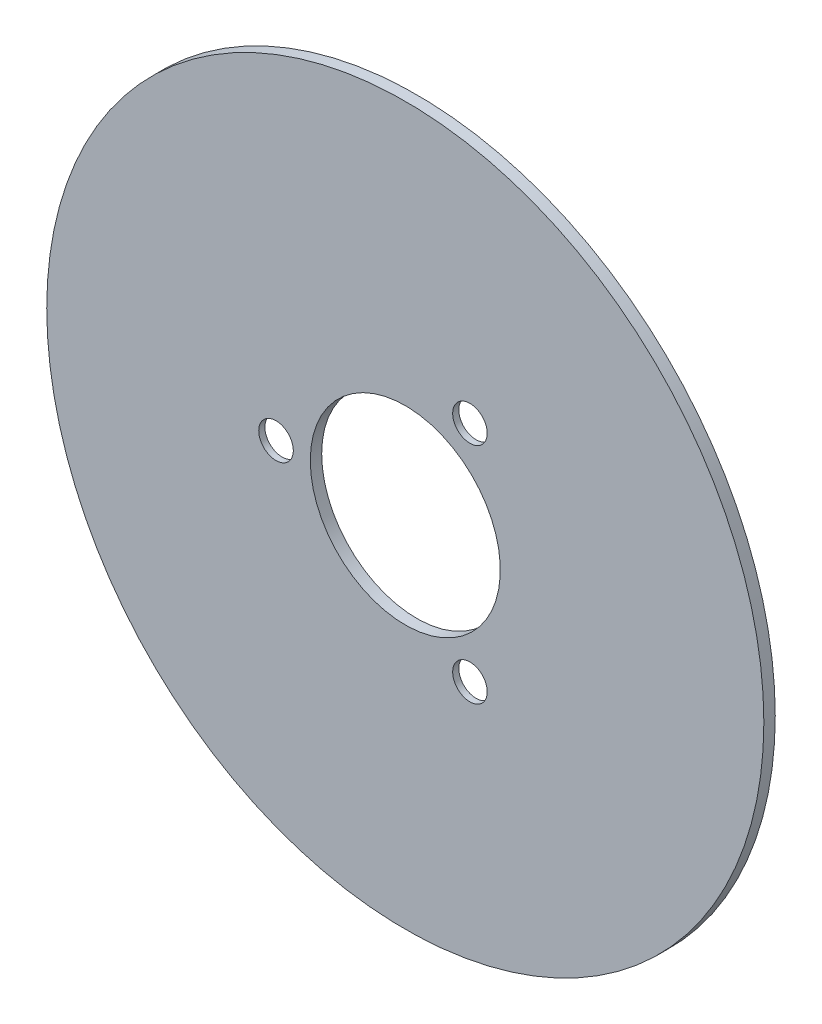
ISO-10303-21;
HEADER;
FILE_DESCRIPTION(('STEP AP214'),'2;1');
FILE_NAME('part.step','',(''),(''),'','','');
FILE_SCHEMA(('AUTOMOTIVE_DESIGN { 1 0 10303 214 1 1 1 1 }'));
ENDSEC;
DATA;
#1=APPLICATION_CONTEXT('core data for automotive mechanical design processes');
#2=APPLICATION_PROTOCOL_DEFINITION('international standard','automotive_design',2000,#1);
#3=PRODUCT_CONTEXT('',#1,'mechanical');
#4=PRODUCT('Part','Part','',(#3));
#5=PRODUCT_RELATED_PRODUCT_CATEGORY('part','',(#4));
#6=PRODUCT_DEFINITION_FORMATION('','',#4);
#7=PRODUCT_DEFINITION_CONTEXT('part definition',#1,'design');
#8=PRODUCT_DEFINITION('design','',#6,#7);
#9=PRODUCT_DEFINITION_SHAPE('','',#8);
#10=(LENGTH_UNIT() NAMED_UNIT(*) SI_UNIT(.MILLI.,.METRE.));
#11=(NAMED_UNIT(*) PLANE_ANGLE_UNIT() SI_UNIT($,.RADIAN.));
#12=(NAMED_UNIT(*) SI_UNIT($,.STERADIAN.) SOLID_ANGLE_UNIT());
#13=UNCERTAINTY_MEASURE_WITH_UNIT(LENGTH_MEASURE(1.E-05),#10,'distance_accuracy_value','');
#14=(GEOMETRIC_REPRESENTATION_CONTEXT(3) GLOBAL_UNCERTAINTY_ASSIGNED_CONTEXT((#13)) GLOBAL_UNIT_ASSIGNED_CONTEXT((#10,
#11,#12)) REPRESENTATION_CONTEXT('',''));
#15=CARTESIAN_POINT('',(0.,0.,0.));
#16=DIRECTION('',(0.,0.,1.));
#17=DIRECTION('',(1.,0.,0.));
#18=AXIS2_PLACEMENT_3D('',#15,#16,#17);
#19=CARTESIAN_POINT('',(0.,0.,3.5));
#20=DIRECTION('',(0.,0.,-1.));
#21=DIRECTION('',(-1.,0.,0.));
#22=AXIS2_PLACEMENT_3D('',#19,#20,#21);
#23=CYLINDRICAL_SURFACE('',#22,29.15);
#24=CARTESIAN_POINT('',(0.,0.,3.5));
#25=DIRECTION('',(0.,0.,-1.));
#26=DIRECTION('',(-1.,0.,0.));
#27=AXIS2_PLACEMENT_3D('',#24,#25,#26);
#28=CIRCLE('',#27,29.15);
#29=CARTESIAN_POINT('',(-29.15,0.,3.5));
#30=VERTEX_POINT('',#29);
#31=EDGE_CURVE('E56',#30,#30,#28,.T.);
#32=ORIENTED_EDGE('',*,*,#31,.F.);
#33=EDGE_LOOP('',(#32));
#34=FACE_BOUND('',#33,.T.);
#35=CARTESIAN_POINT('',(0.,0.,0.00100000000000013));
#36=DIRECTION('',(0.,0.,-1.));
#37=DIRECTION('',(-1.,0.,0.));
#38=AXIS2_PLACEMENT_3D('',#35,#36,#37);
#39=CIRCLE('',#38,29.15);
#40=CARTESIAN_POINT('',(-29.15,0.,0.00100000000000013));
#41=VERTEX_POINT('',#40);
#42=EDGE_CURVE('E91',#41,#41,#39,.F.);
#43=ORIENTED_EDGE('',*,*,#42,.F.);
#44=EDGE_LOOP('',(#43));
#45=FACE_BOUND('',#44,.T.);
#46=ADVANCED_FACE('F41',(#34,#45),#23,.F.);
#47=CARTESIAN_POINT('',(19.8312500000002,34.3487325776002,1.62));
#48=DIRECTION('',(0.,0.,-1.));
#49=DIRECTION('',(-1.,0.,0.));
#50=AXIS2_PLACEMENT_3D('',#47,#48,#49);
#51=CYLINDRICAL_SURFACE('',#50,8.55);
#52=CARTESIAN_POINT('',(19.8312500000002,34.3487325776002,1.62));
#53=DIRECTION('',(0.,0.,-1.));
#54=DIRECTION('',(-1.,0.,0.));
#55=AXIS2_PLACEMENT_3D('',#52,#53,#54);
#56=CIRCLE('',#55,8.55);
#57=CARTESIAN_POINT('',(11.2812500000002,34.3487325776002,1.62));
#58=VERTEX_POINT('',#57);
#59=EDGE_CURVE('E62',#58,#58,#56,.T.);
#60=ORIENTED_EDGE('',*,*,#59,.F.);
#61=EDGE_LOOP('',(#60));
#62=FACE_BOUND('',#61,.T.);
#63=CARTESIAN_POINT('',(19.8312500000002,34.3487325776002,0.000999999999999916));
#64=DIRECTION('',(0.,0.,-1.));
#65=DIRECTION('',(-1.,0.,0.));
#66=AXIS2_PLACEMENT_3D('',#63,#64,#65);
#67=CIRCLE('',#66,8.55);
#68=CARTESIAN_POINT('',(11.2812500000002,34.3487325776002,0.000999999999999916));
#69=VERTEX_POINT('',#68);
#70=EDGE_CURVE('E101',#69,#69,#67,.F.);
#71=ORIENTED_EDGE('',*,*,#70,.F.);
#72=EDGE_LOOP('',(#71));
#73=FACE_BOUND('',#72,.T.);
#74=ADVANCED_FACE('F136',(#62,#73),#51,.F.);
#75=CARTESIAN_POINT('',(19.8312500000002,-34.3487325776002,1.62));
#76=DIRECTION('',(0.,0.,-1.));
#77=DIRECTION('',(-1.,0.,0.));
#78=AXIS2_PLACEMENT_3D('',#75,#76,#77);
#79=CYLINDRICAL_SURFACE('',#78,8.55);
#80=CARTESIAN_POINT('',(19.8312500000002,-34.3487325776002,1.62));
#81=DIRECTION('',(0.,0.,-1.));
#82=DIRECTION('',(-1.,0.,0.));
#83=AXIS2_PLACEMENT_3D('',#80,#81,#82);
#84=CIRCLE('',#83,8.55);
#85=CARTESIAN_POINT('',(11.2812500000002,-34.3487325776002,1.62));
#86=VERTEX_POINT('',#85);
#87=EDGE_CURVE('E66',#86,#86,#84,.T.);
#88=ORIENTED_EDGE('',*,*,#87,.F.);
#89=EDGE_LOOP('',(#88));
#90=FACE_BOUND('',#89,.T.);
#91=CARTESIAN_POINT('',(19.8312500000002,-34.3487325776002,0.000999999999999916));
#92=DIRECTION('',(0.,0.,-1.));
#93=DIRECTION('',(-1.,0.,0.));
#94=AXIS2_PLACEMENT_3D('',#91,#92,#93);
#95=CIRCLE('',#94,8.55);
#96=CARTESIAN_POINT('',(11.2812500000002,-34.3487325776002,0.000999999999999916));
#97=VERTEX_POINT('',#96);
#98=EDGE_CURVE('E105',#97,#97,#95,.F.);
#99=ORIENTED_EDGE('',*,*,#98,.F.);
#100=EDGE_LOOP('',(#99));
#101=FACE_BOUND('',#100,.T.);
#102=ADVANCED_FACE('F127',(#90,#101),#79,.F.);
#103=CARTESIAN_POINT('',(-39.6625,0.,1.62));
#104=DIRECTION('',(0.,0.,-1.));
#105=DIRECTION('',(-1.,0.,0.));
#106=AXIS2_PLACEMENT_3D('',#103,#104,#105);
#107=CYLINDRICAL_SURFACE('',#106,8.55);
#108=CARTESIAN_POINT('',(-39.6625,0.,1.62));
#109=DIRECTION('',(0.,0.,-1.));
#110=DIRECTION('',(-1.,0.,0.));
#111=AXIS2_PLACEMENT_3D('',#108,#109,#110);
#112=CIRCLE('',#111,8.55);
#113=CARTESIAN_POINT('',(-48.2125,0.,1.62));
#114=VERTEX_POINT('',#113);
#115=EDGE_CURVE('E61',#114,#114,#112,.T.);
#116=ORIENTED_EDGE('',*,*,#115,.F.);
#117=EDGE_LOOP('',(#116));
#118=FACE_BOUND('',#117,.T.);
#119=CARTESIAN_POINT('',(-39.6625,0.,0.000999999999999916));
#120=DIRECTION('',(0.,0.,-1.));
#121=DIRECTION('',(-1.,0.,0.));
#122=AXIS2_PLACEMENT_3D('',#119,#120,#121);
#123=CIRCLE('',#122,8.55);
#124=CARTESIAN_POINT('',(-48.2125,0.,0.000999999999999916));
#125=VERTEX_POINT('',#124);
#126=EDGE_CURVE('E45',#125,#125,#123,.F.);
#127=ORIENTED_EDGE('',*,*,#126,.F.);
#128=EDGE_LOOP('',(#127));
#129=FACE_BOUND('',#128,.T.);
#130=ADVANCED_FACE('F125',(#118,#129),#107,.F.);
#131=CARTESIAN_POINT('',(0.,0.,3.5));
#132=DIRECTION('',(0.,0.,-1.));
#133=DIRECTION('',(-1.,0.,0.));
#134=AXIS2_PLACEMENT_3D('',#131,#132,#133);
#135=CYLINDRICAL_SURFACE('',#134,110.);
#136=CARTESIAN_POINT('',(0.,0.,3.5));
#137=DIRECTION('',(0.,0.,1.));
#138=DIRECTION('',(1.,0.,0.));
#139=AXIS2_PLACEMENT_3D('',#136,#137,#138);
#140=CIRCLE('',#139,110.);
#141=CARTESIAN_POINT('',(110.,0.,3.5));
#142=VERTEX_POINT('',#141);
#143=EDGE_CURVE('E10',#142,#142,#140,.T.);
#144=ORIENTED_EDGE('',*,*,#143,.F.);
#145=EDGE_LOOP('',(#144));
#146=FACE_BOUND('',#145,.T.);
#147=CARTESIAN_POINT('',(0.,0.,0.));
#148=DIRECTION('',(0.,0.,1.));
#149=DIRECTION('',(1.,0.,0.));
#150=AXIS2_PLACEMENT_3D('',#147,#148,#149);
#151=CIRCLE('',#150,110.);
#152=CARTESIAN_POINT('',(110.,0.,0.));
#153=VERTEX_POINT('',#152);
#154=EDGE_CURVE('E50',#153,#153,#151,.T.);
#155=ORIENTED_EDGE('',*,*,#154,.T.);
#156=EDGE_LOOP('',(#155));
#157=FACE_BOUND('',#156,.T.);
#158=ADVANCED_FACE('F43',(#146,#157),#135,.T.);
#159=CARTESIAN_POINT('',(0.,0.,3.5));
#160=DIRECTION('',(0.,0.,1.));
#161=DIRECTION('',(1.,0.,0.));
#162=AXIS2_PLACEMENT_3D('',#159,#160,#161);
#163=PLANE('',#162);
#164=CARTESIAN_POINT('',(19.8312500000002,-34.3487325776002,3.5));
#165=DIRECTION('',(0.,0.,-1.));
#166=DIRECTION('',(-1.,0.,0.));
#167=AXIS2_PLACEMENT_3D('',#164,#165,#166);
#168=CIRCLE('',#167,5.3);
#169=CARTESIAN_POINT('',(14.5312500000002,-34.3487325776002,3.5));
#170=VERTEX_POINT('',#169);
#171=EDGE_CURVE('E85',#170,#170,#168,.T.);
#172=ORIENTED_EDGE('',*,*,#171,.T.);
#173=EDGE_LOOP('',(#172));
#174=FACE_BOUND('',#173,.T.);
#175=CARTESIAN_POINT('',(-39.6625,0.,3.5));
#176=DIRECTION('',(0.,0.,-1.));
#177=DIRECTION('',(-1.,0.,0.));
#178=AXIS2_PLACEMENT_3D('',#175,#176,#177);
#179=CIRCLE('',#178,5.3);
#180=CARTESIAN_POINT('',(-44.9625,0.,3.5));
#181=VERTEX_POINT('',#180);
#182=EDGE_CURVE('E90',#181,#181,#179,.T.);
#183=ORIENTED_EDGE('',*,*,#182,.T.);
#184=EDGE_LOOP('',(#183));
#185=FACE_BOUND('',#184,.T.);
#186=CARTESIAN_POINT('',(19.8312500000002,34.3487325776002,3.5));
#187=DIRECTION('',(0.,0.,-1.));
#188=DIRECTION('',(-1.,0.,0.));
#189=AXIS2_PLACEMENT_3D('',#186,#187,#188);
#190=CIRCLE('',#189,5.3);
#191=CARTESIAN_POINT('',(14.5312500000002,34.3487325776002,3.5));
#192=VERTEX_POINT('',#191);
#193=EDGE_CURVE('E86',#192,#192,#190,.T.);
#194=ORIENTED_EDGE('',*,*,#193,.T.);
#195=EDGE_LOOP('',(#194));
#196=FACE_BOUND('',#195,.T.);
#197=ORIENTED_EDGE('',*,*,#31,.T.);
#198=EDGE_LOOP('',(#197));
#199=FACE_BOUND('',#198,.T.);
#200=ORIENTED_EDGE('',*,*,#143,.T.);
#201=EDGE_LOOP('',(#200));
#202=FACE_BOUND('',#201,.T.);
#203=ADVANCED_FACE('F134',(#174,#185,#196,#199,#202),#163,.T.);
#204=CARTESIAN_POINT('',(0.,0.,0.));
#205=DIRECTION('',(0.,0.,1.));
#206=DIRECTION('',(1.,0.,0.));
#207=AXIS2_PLACEMENT_3D('',#204,#205,#206);
#208=PLANE('',#207);
#209=CARTESIAN_POINT('',(0.,0.,0.));
#210=DIRECTION('',(0.,0.,-1.));
#211=DIRECTION('',(-1.,0.,0.));
#212=AXIS2_PLACEMENT_3D('',#209,#210,#211);
#213=CIRCLE('',#212,80.);
#214=CARTESIAN_POINT('',(-80.,0.,0.));
#215=VERTEX_POINT('',#214);
#216=EDGE_CURVE('E109',#215,#215,#213,.T.);
#217=ORIENTED_EDGE('',*,*,#216,.F.);
#218=EDGE_LOOP('',(#217));
#219=FACE_BOUND('',#218,.T.);
#220=ORIENTED_EDGE('',*,*,#154,.F.);
#221=EDGE_LOOP('',(#220));
#222=FACE_BOUND('',#221,.T.);
#223=ADVANCED_FACE('F155',(#219,#222),#208,.F.);
#224=CARTESIAN_POINT('',(19.8312500000002,34.3487325776002,1.62));
#225=DIRECTION('',(0.,0.,-1.));
#226=DIRECTION('',(-1.,0.,0.));
#227=AXIS2_PLACEMENT_3D('',#224,#225,#226);
#228=PLANE('',#227);
#229=CARTESIAN_POINT('',(19.8312500000002,34.3487325776002,1.62));
#230=DIRECTION('',(0.,0.,-1.));
#231=DIRECTION('',(-1.,0.,0.));
#232=AXIS2_PLACEMENT_3D('',#229,#230,#231);
#233=CIRCLE('',#232,5.3);
#234=CARTESIAN_POINT('',(14.5312500000002,34.3487325776002,1.62));
#235=VERTEX_POINT('',#234);
#236=EDGE_CURVE('E67',#235,#235,#233,.T.);
#237=ORIENTED_EDGE('',*,*,#236,.F.);
#238=EDGE_LOOP('',(#237));
#239=FACE_BOUND('',#238,.T.);
#240=ORIENTED_EDGE('',*,*,#59,.T.);
#241=EDGE_LOOP('',(#240));
#242=FACE_BOUND('',#241,.T.);
#243=ADVANCED_FACE('F153',(#239,#242),#228,.T.);
#244=CARTESIAN_POINT('',(19.8312500000002,-34.3487325776002,1.62));
#245=DIRECTION('',(0.,0.,-1.));
#246=DIRECTION('',(-1.,0.,0.));
#247=AXIS2_PLACEMENT_3D('',#244,#245,#246);
#248=PLANE('',#247);
#249=CARTESIAN_POINT('',(19.8312500000002,-34.3487325776002,1.62));
#250=DIRECTION('',(0.,0.,-1.));
#251=DIRECTION('',(-1.,0.,0.));
#252=AXIS2_PLACEMENT_3D('',#249,#250,#251);
#253=CIRCLE('',#252,5.3);
#254=CARTESIAN_POINT('',(14.5312500000002,-34.3487325776002,1.62));
#255=VERTEX_POINT('',#254);
#256=EDGE_CURVE('E77',#255,#255,#253,.T.);
#257=ORIENTED_EDGE('',*,*,#256,.F.);
#258=EDGE_LOOP('',(#257));
#259=FACE_BOUND('',#258,.T.);
#260=ORIENTED_EDGE('',*,*,#87,.T.);
#261=EDGE_LOOP('',(#260));
#262=FACE_BOUND('',#261,.T.);
#263=ADVANCED_FACE('F162',(#259,#262),#248,.T.);
#264=CARTESIAN_POINT('',(-39.6625,0.,1.62));
#265=DIRECTION('',(0.,0.,-1.));
#266=DIRECTION('',(-1.,0.,0.));
#267=AXIS2_PLACEMENT_3D('',#264,#265,#266);
#268=PLANE('',#267);
#269=CARTESIAN_POINT('',(-39.6625,0.,1.62));
#270=DIRECTION('',(0.,0.,-1.));
#271=DIRECTION('',(-1.,0.,0.));
#272=AXIS2_PLACEMENT_3D('',#269,#270,#271);
#273=CIRCLE('',#272,5.3);
#274=CARTESIAN_POINT('',(-44.9625,0.,1.62));
#275=VERTEX_POINT('',#274);
#276=EDGE_CURVE('E81',#275,#275,#273,.T.);
#277=ORIENTED_EDGE('',*,*,#276,.F.);
#278=EDGE_LOOP('',(#277));
#279=FACE_BOUND('',#278,.T.);
#280=ORIENTED_EDGE('',*,*,#115,.T.);
#281=EDGE_LOOP('',(#280));
#282=FACE_BOUND('',#281,.T.);
#283=ADVANCED_FACE('F186',(#279,#282),#268,.T.);
#284=CARTESIAN_POINT('',(-39.6625,0.,3.5));
#285=DIRECTION('',(0.,0.,-1.));
#286=DIRECTION('',(-1.,0.,0.));
#287=AXIS2_PLACEMENT_3D('',#284,#285,#286);
#288=CYLINDRICAL_SURFACE('',#287,5.3);
#289=ORIENTED_EDGE('',*,*,#276,.T.);
#290=EDGE_LOOP('',(#289));
#291=FACE_BOUND('',#290,.T.);
#292=ORIENTED_EDGE('',*,*,#182,.F.);
#293=EDGE_LOOP('',(#292));
#294=FACE_BOUND('',#293,.T.);
#295=ADVANCED_FACE('F182',(#291,#294),#288,.F.);
#296=CARTESIAN_POINT('',(19.8312500000002,-34.3487325776002,3.5));
#297=DIRECTION('',(0.,0.,-1.));
#298=DIRECTION('',(-1.,0.,0.));
#299=AXIS2_PLACEMENT_3D('',#296,#297,#298);
#300=CYLINDRICAL_SURFACE('',#299,5.3);
#301=ORIENTED_EDGE('',*,*,#256,.T.);
#302=EDGE_LOOP('',(#301));
#303=FACE_BOUND('',#302,.T.);
#304=ORIENTED_EDGE('',*,*,#171,.F.);
#305=EDGE_LOOP('',(#304));
#306=FACE_BOUND('',#305,.T.);
#307=ADVANCED_FACE('F179',(#303,#306),#300,.F.);
#308=CARTESIAN_POINT('',(19.8312500000002,34.3487325776002,3.5));
#309=DIRECTION('',(0.,0.,-1.));
#310=DIRECTION('',(-1.,0.,0.));
#311=AXIS2_PLACEMENT_3D('',#308,#309,#310);
#312=CYLINDRICAL_SURFACE('',#311,5.3);
#313=ORIENTED_EDGE('',*,*,#236,.T.);
#314=EDGE_LOOP('',(#313));
#315=FACE_BOUND('',#314,.T.);
#316=ORIENTED_EDGE('',*,*,#193,.F.);
#317=EDGE_LOOP('',(#316));
#318=FACE_BOUND('',#317,.T.);
#319=ADVANCED_FACE('F176',(#315,#318),#312,.F.);
#320=CARTESIAN_POINT('',(0.,0.,0.001));
#321=DIRECTION('',(0.,0.,-1.));
#322=DIRECTION('',(-1.,0.,0.));
#323=AXIS2_PLACEMENT_3D('',#320,#321,#322);
#324=PLANE('',#323);
#325=CARTESIAN_POINT('',(0.,0.,0.001));
#326=DIRECTION('',(0.,0.,-1.));
#327=DIRECTION('',(-1.,0.,0.));
#328=AXIS2_PLACEMENT_3D('',#325,#326,#327);
#329=CIRCLE('',#328,80.);
#330=CARTESIAN_POINT('',(-80.,0.,0.001));
#331=VERTEX_POINT('',#330);
#332=EDGE_CURVE('E113',#331,#331,#329,.T.);
#333=ORIENTED_EDGE('',*,*,#332,.T.);
#334=EDGE_LOOP('',(#333));
#335=FACE_BOUND('',#334,.T.);
#336=ORIENTED_EDGE('',*,*,#126,.T.);
#337=EDGE_LOOP('',(#336));
#338=FACE_BOUND('',#337,.T.);
#339=ORIENTED_EDGE('',*,*,#98,.T.);
#340=EDGE_LOOP('',(#339));
#341=FACE_BOUND('',#340,.T.);
#342=ORIENTED_EDGE('',*,*,#70,.T.);
#343=EDGE_LOOP('',(#342));
#344=FACE_BOUND('',#343,.T.);
#345=ORIENTED_EDGE('',*,*,#42,.T.);
#346=EDGE_LOOP('',(#345));
#347=FACE_BOUND('',#346,.T.);
#348=ADVANCED_FACE('F122',(#335,#338,#341,#344,#347),#324,.T.);
#349=CARTESIAN_POINT('',(0.,0.,0.001));
#350=DIRECTION('',(0.,0.,-1.));
#351=DIRECTION('',(-1.,0.,0.));
#352=AXIS2_PLACEMENT_3D('',#349,#350,#351);
#353=CYLINDRICAL_SURFACE('',#352,80.);
#354=ORIENTED_EDGE('',*,*,#332,.F.);
#355=EDGE_LOOP('',(#354));
#356=FACE_BOUND('',#355,.T.);
#357=ORIENTED_EDGE('',*,*,#216,.T.);
#358=EDGE_LOOP('',(#357));
#359=FACE_BOUND('',#358,.T.);
#360=ADVANCED_FACE('F169',(#356,#359),#353,.F.);
#361=CLOSED_SHELL('',(#46,#74,#102,#130,#158,#203,#223,#243,#263,#283,#295,#307,#319,#348,#360));
#362=MANIFOLD_SOLID_BREP('B2',#361);
#363=ADVANCED_BREP_SHAPE_REPRESENTATION('',(#18,#362),#14);
#364=SHAPE_DEFINITION_REPRESENTATION(#9,#363);
ENDSEC;
END-ISO-10303-21;
